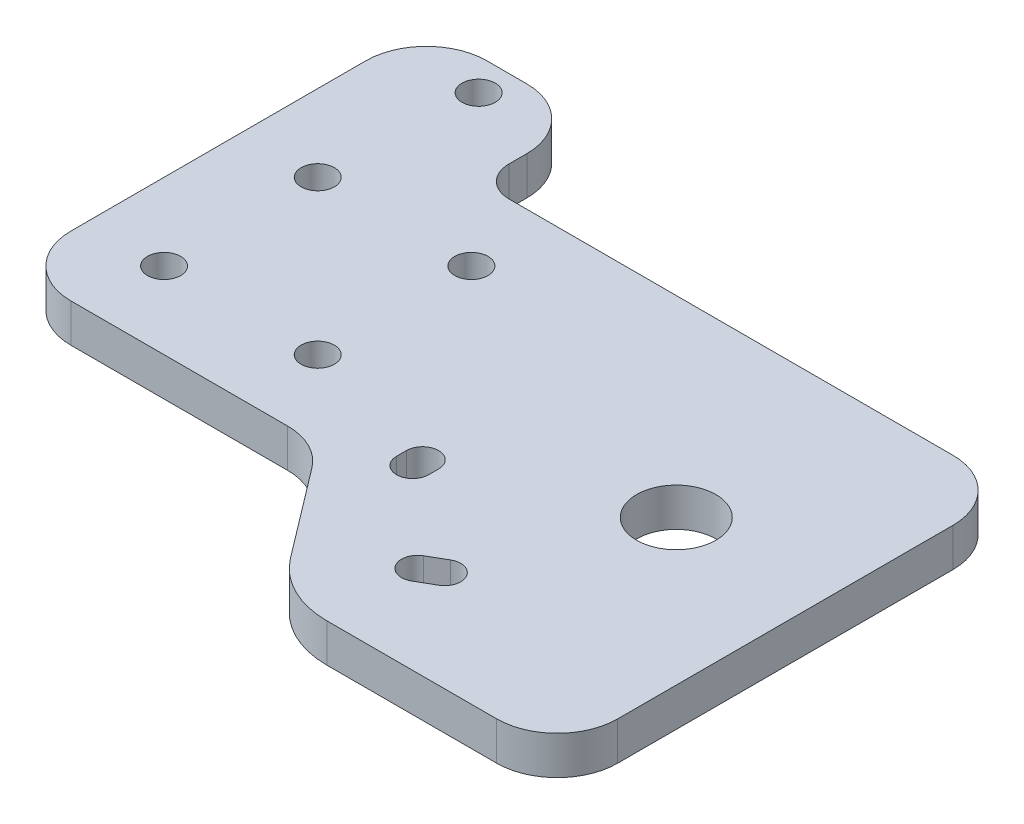
ISO-10303-21;
HEADER;
FILE_DESCRIPTION(('STEP AP214'),'2;1');
FILE_NAME('part.step','',(''),(''),'','','');
FILE_SCHEMA(('AUTOMOTIVE_DESIGN { 1 0 10303 214 1 1 1 1 }'));
ENDSEC;
DATA;
#1=APPLICATION_CONTEXT('core data for automotive mechanical design processes');
#2=APPLICATION_PROTOCOL_DEFINITION('international standard','automotive_design',2000,#1);
#3=PRODUCT_CONTEXT('',#1,'mechanical');
#4=PRODUCT('Part','Part','',(#3));
#5=PRODUCT_RELATED_PRODUCT_CATEGORY('part','',(#4));
#6=PRODUCT_DEFINITION_FORMATION('','',#4);
#7=PRODUCT_DEFINITION_CONTEXT('part definition',#1,'design');
#8=PRODUCT_DEFINITION('design','',#6,#7);
#9=PRODUCT_DEFINITION_SHAPE('','',#8);
#10=(LENGTH_UNIT() NAMED_UNIT(*) SI_UNIT(.MILLI.,.METRE.));
#11=(NAMED_UNIT(*) PLANE_ANGLE_UNIT() SI_UNIT($,.RADIAN.));
#12=(NAMED_UNIT(*) SI_UNIT($,.STERADIAN.) SOLID_ANGLE_UNIT());
#13=UNCERTAINTY_MEASURE_WITH_UNIT(LENGTH_MEASURE(1.E-05),#10,'distance_accuracy_value','');
#14=(GEOMETRIC_REPRESENTATION_CONTEXT(3) GLOBAL_UNCERTAINTY_ASSIGNED_CONTEXT((#13)) GLOBAL_UNIT_ASSIGNED_CONTEXT((#10,
#11,#12)) REPRESENTATION_CONTEXT('',''));
#15=CARTESIAN_POINT('',(0.,0.,0.));
#16=DIRECTION('',(0.,0.,1.));
#17=DIRECTION('',(1.,0.,0.));
#18=AXIS2_PLACEMENT_3D('',#15,#16,#17);
#19=CARTESIAN_POINT('',(-25.4,6.35,25.4));
#20=DIRECTION('',(1.,0.,0.));
#21=DIRECTION('',(0.,0.,-1.));
#22=AXIS2_PLACEMENT_3D('',#19,#20,#21);
#23=PLANE('',#22);
#24=DIRECTION('',(0.,0.,1.));
#25=VECTOR('',#24,1.);
#26=CARTESIAN_POINT('',(-25.4,6.35,-25.4));
#27=LINE('',#26,#25);
#28=CARTESIAN_POINT('',(-25.4,6.35,-33.35));
#29=VERTEX_POINT('',#28);
#30=CARTESIAN_POINT('',(-25.4,6.35,15.4));
#31=VERTEX_POINT('',#30);
#32=EDGE_CURVE('E303',#29,#31,#27,.T.);
#33=ORIENTED_EDGE('',*,*,#32,.F.);
#34=DIRECTION('',(0.,-1.,0.));
#35=VECTOR('',#34,1.);
#36=CARTESIAN_POINT('',(-25.4,6.35,-33.35));
#37=LINE('',#36,#35);
#38=CARTESIAN_POINT('',(-25.4,0.,-33.35));
#39=VERTEX_POINT('',#38);
#40=EDGE_CURVE('E356',#29,#39,#37,.T.);
#41=ORIENTED_EDGE('',*,*,#40,.T.);
#42=DIRECTION('',(0.,0.,1.));
#43=VECTOR('',#42,1.);
#44=CARTESIAN_POINT('',(-25.4,0.,25.4));
#45=LINE('',#44,#43);
#46=CARTESIAN_POINT('',(-25.4,0.,15.4));
#47=VERTEX_POINT('',#46);
#48=EDGE_CURVE('E302',#39,#47,#45,.T.);
#49=ORIENTED_EDGE('',*,*,#48,.T.);
#50=DIRECTION('',(0.,-1.,0.));
#51=VECTOR('',#50,1.);
#52=CARTESIAN_POINT('',(-25.4,6.35,15.4));
#53=LINE('',#52,#51);
#54=EDGE_CURVE('E354',#47,#31,#53,.F.);
#55=ORIENTED_EDGE('',*,*,#54,.T.);
#56=EDGE_LOOP('',(#33,#41,#49,#55));
#57=FACE_BOUND('',#56,.T.);
#58=ADVANCED_FACE('F32',(#57),#23,.F.);
#59=CARTESIAN_POINT('',(25.4,6.35,25.4));
#60=DIRECTION('',(0.,0.,-1.));
#61=DIRECTION('',(-1.,0.,0.));
#62=AXIS2_PLACEMENT_3D('',#59,#60,#61);
#63=PLANE('',#62);
#64=DIRECTION('',(1.,0.,0.));
#65=VECTOR('',#64,1.);
#66=CARTESIAN_POINT('',(25.4,6.35,25.4));
#67=LINE('',#66,#65);
#68=CARTESIAN_POINT('',(-15.4,6.35,25.4));
#69=VERTEX_POINT('',#68);
#70=CARTESIAN_POINT('',(20.4344979889263,6.35,25.4));
#71=VERTEX_POINT('',#70);
#72=EDGE_CURVE('E306',#69,#71,#67,.T.);
#73=ORIENTED_EDGE('',*,*,#72,.F.);
#74=DIRECTION('',(0.,-1.,0.));
#75=VECTOR('',#74,1.);
#76=CARTESIAN_POINT('',(-15.4,6.35,25.4));
#77=LINE('',#76,#75);
#78=CARTESIAN_POINT('',(-15.4,0.,25.4));
#79=VERTEX_POINT('',#78);
#80=EDGE_CURVE('E397',#69,#79,#77,.T.);
#81=ORIENTED_EDGE('',*,*,#80,.T.);
#82=DIRECTION('',(1.,0.,0.));
#83=VECTOR('',#82,1.);
#84=CARTESIAN_POINT('',(25.4,0.,25.4));
#85=LINE('',#84,#83);
#86=CARTESIAN_POINT('',(20.4344979889263,0.,25.4));
#87=VERTEX_POINT('',#86);
#88=EDGE_CURVE('E330',#79,#87,#85,.T.);
#89=ORIENTED_EDGE('',*,*,#88,.T.);
#90=DIRECTION('',(0.,-1.,0.));
#91=VECTOR('',#90,1.);
#92=CARTESIAN_POINT('',(20.4344979889263,6.35,25.4));
#93=LINE('',#92,#91);
#94=EDGE_CURVE('E395',#87,#71,#93,.F.);
#95=ORIENTED_EDGE('',*,*,#94,.T.);
#96=EDGE_LOOP('',(#73,#81,#89,#95));
#97=FACE_BOUND('',#96,.T.);
#98=ADVANCED_FACE('F446',(#97),#63,.F.);
#99=CARTESIAN_POINT('',(25.4,6.35,25.4));
#100=DIRECTION('',(0.796671421701581,0.,-0.604412645337589));
#101=DIRECTION('',(-0.604412645337589,0.,-0.796671421701581));
#102=AXIS2_PLACEMENT_3D('',#99,#100,#101);
#103=PLANE('',#102);
#104=DIRECTION('',(0.604412645337589,0.,0.796671421701581));
#105=VECTOR('',#104,1.);
#106=CARTESIAN_POINT('',(25.4,6.35,25.4));
#107=LINE('',#106,#105);
#108=CARTESIAN_POINT('',(28.4012122059421,6.35,29.3558735466241));
#109=VERTEX_POINT('',#108);
#110=CARTESIAN_POINT('',(39.5918704257842,6.35,44.1061896800638));
#111=VERTEX_POINT('',#110);
#112=EDGE_CURVE('E310',#109,#111,#107,.T.);
#113=ORIENTED_EDGE('',*,*,#112,.F.);
#114=DIRECTION('',(0.,-1.,0.));
#115=VECTOR('',#114,1.);
#116=CARTESIAN_POINT('',(28.4012122059421,0.,29.3558735466241));
#117=LINE('',#116,#115);
#118=CARTESIAN_POINT('',(28.4012122059421,0.,29.3558735466241));
#119=VERTEX_POINT('',#118);
#120=EDGE_CURVE('E400',#109,#119,#117,.T.);
#121=ORIENTED_EDGE('',*,*,#120,.T.);
#122=DIRECTION('',(0.604412645337589,0.,0.796671421701581));
#123=VECTOR('',#122,1.);
#124=CARTESIAN_POINT('',(25.4,0.,25.4));
#125=LINE('',#124,#123);
#126=CARTESIAN_POINT('',(39.5918704257842,0.,44.1061896800638));
#127=VERTEX_POINT('',#126);
#128=EDGE_CURVE('E333',#119,#127,#125,.T.);
#129=ORIENTED_EDGE('',*,*,#128,.T.);
#130=DIRECTION('',(0.,-1.,0.));
#131=VECTOR('',#130,1.);
#132=CARTESIAN_POINT('',(39.5918704257842,6.35,44.1061896800638));
#133=LINE('',#132,#131);
#134=EDGE_CURVE('E351',#111,#127,#133,.T.);
#135=ORIENTED_EDGE('',*,*,#134,.F.);
#136=EDGE_LOOP('',(#113,#121,#129,#135));
#137=FACE_BOUND('',#136,.T.);
#138=ADVANCED_FACE('F455',(#137),#103,.F.);
#139=CARTESIAN_POINT('',(51.5419417513079,6.35,35.04));
#140=DIRECTION('',(0.,-1.,0.));
#141=DIRECTION('',(0.,0.,-1.));
#142=AXIS2_PLACEMENT_3D('',#139,#140,#141);
#143=CYLINDRICAL_SURFACE('',#142,15.);
#144=CARTESIAN_POINT('',(51.5419417513079,0.,35.04));
#145=DIRECTION('',(0.,1.,0.));
#146=DIRECTION('',(0.,0.,1.));
#147=AXIS2_PLACEMENT_3D('',#144,#145,#146);
#148=CIRCLE('',#147,15.);
#149=CARTESIAN_POINT('',(51.5419417513079,0.,50.04));
#150=VERTEX_POINT('',#149);
#151=EDGE_CURVE('E335',#127,#150,#148,.T.);
#152=ORIENTED_EDGE('',*,*,#151,.T.);
#153=DIRECTION('',(0.,-1.,0.));
#154=VECTOR('',#153,1.);
#155=CARTESIAN_POINT('',(51.5419417513079,6.35,50.04));
#156=LINE('',#155,#154);
#157=CARTESIAN_POINT('',(51.5419417513079,6.35,50.04));
#158=VERTEX_POINT('',#157);
#159=EDGE_CURVE('E327',#158,#150,#156,.T.);
#160=ORIENTED_EDGE('',*,*,#159,.F.);
#161=CARTESIAN_POINT('',(51.5419417513079,6.35,35.04));
#162=DIRECTION('',(0.,1.,0.));
#163=DIRECTION('',(0.,0.,1.));
#164=AXIS2_PLACEMENT_3D('',#161,#162,#163);
#165=CIRCLE('',#164,15.);
#166=EDGE_CURVE('E312',#111,#158,#165,.T.);
#167=ORIENTED_EDGE('',*,*,#166,.F.);
#168=ORIENTED_EDGE('',*,*,#134,.T.);
#169=EDGE_LOOP('',(#152,#160,#167,#168));
#170=FACE_BOUND('',#169,.T.);
#171=ADVANCED_FACE('F461',(#170),#143,.T.);
#172=CARTESIAN_POINT('',(51.5419417513079,6.35,50.04));
#173=DIRECTION('',(0.,0.,-1.));
#174=DIRECTION('',(-1.,0.,0.));
#175=AXIS2_PLACEMENT_3D('',#172,#173,#174);
#176=PLANE('',#175);
#177=DIRECTION('',(1.,0.,0.));
#178=VECTOR('',#177,1.);
#179=CARTESIAN_POINT('',(51.5419417513079,0.,50.04));
#180=LINE('',#179,#178);
#181=CARTESIAN_POINT('',(79.6212098591925,0.,50.04));
#182=VERTEX_POINT('',#181);
#183=EDGE_CURVE('E337',#150,#182,#180,.T.);
#184=ORIENTED_EDGE('',*,*,#183,.T.);
#185=DIRECTION('',(0.,-1.,0.));
#186=VECTOR('',#185,1.);
#187=CARTESIAN_POINT('',(79.6212098591925,6.35,50.04));
#188=LINE('',#187,#186);
#189=CARTESIAN_POINT('',(79.6212098591925,6.35,50.04));
#190=VERTEX_POINT('',#189);
#191=EDGE_CURVE('E393',#182,#190,#188,.F.);
#192=ORIENTED_EDGE('',*,*,#191,.T.);
#193=DIRECTION('',(1.,0.,0.));
#194=VECTOR('',#193,1.);
#195=CARTESIAN_POINT('',(51.5419417513079,6.35,50.04));
#196=LINE('',#195,#194);
#197=EDGE_CURVE('E314',#158,#190,#196,.T.);
#198=ORIENTED_EDGE('',*,*,#197,.F.);
#199=ORIENTED_EDGE('',*,*,#159,.T.);
#200=EDGE_LOOP('',(#184,#192,#198,#199));
#201=FACE_BOUND('',#200,.T.);
#202=ADVANCED_FACE('F726',(#201),#176,.F.);
#203=CARTESIAN_POINT('',(89.6212098591925,6.35,50.04));
#204=DIRECTION('',(-1.,0.,0.));
#205=DIRECTION('',(0.,0.,1.));
#206=AXIS2_PLACEMENT_3D('',#203,#204,#205);
#207=PLANE('',#206);
#208=DIRECTION('',(0.,0.,-1.));
#209=VECTOR('',#208,1.);
#210=CARTESIAN_POINT('',(89.6212098591925,6.35,50.04));
#211=LINE('',#210,#209);
#212=CARTESIAN_POINT('',(89.6212098591925,6.35,40.04));
#213=VERTEX_POINT('',#212);
#214=CARTESIAN_POINT('',(89.6212098591925,6.35,-15.4));
#215=VERTEX_POINT('',#214);
#216=EDGE_CURVE('E317',#213,#215,#211,.T.);
#217=ORIENTED_EDGE('',*,*,#216,.F.);
#218=DIRECTION('',(0.,-1.,0.));
#219=VECTOR('',#218,1.);
#220=CARTESIAN_POINT('',(89.6212098591925,6.35,40.04));
#221=LINE('',#220,#219);
#222=CARTESIAN_POINT('',(89.6212098591925,0.,40.04));
#223=VERTEX_POINT('',#222);
#224=EDGE_CURVE('E390',#213,#223,#221,.T.);
#225=ORIENTED_EDGE('',*,*,#224,.T.);
#226=DIRECTION('',(0.,0.,-1.));
#227=VECTOR('',#226,1.);
#228=CARTESIAN_POINT('',(89.6212098591925,0.,50.04));
#229=LINE('',#228,#227);
#230=CARTESIAN_POINT('',(89.6212098591925,0.,-15.4));
#231=VERTEX_POINT('',#230);
#232=EDGE_CURVE('E340',#223,#231,#229,.T.);
#233=ORIENTED_EDGE('',*,*,#232,.T.);
#234=DIRECTION('',(0.,-1.,0.));
#235=VECTOR('',#234,1.);
#236=CARTESIAN_POINT('',(89.6212098591925,6.35,-15.4));
#237=LINE('',#236,#235);
#238=EDGE_CURVE('E388',#231,#215,#237,.F.);
#239=ORIENTED_EDGE('',*,*,#238,.T.);
#240=EDGE_LOOP('',(#217,#225,#233,#239));
#241=FACE_BOUND('',#240,.T.);
#242=ADVANCED_FACE('F472',(#241),#207,.F.);
#243=CARTESIAN_POINT('',(1.2,6.35,-25.4));
#244=DIRECTION('',(0.,0.,1.));
#245=DIRECTION('',(1.,0.,0.));
#246=AXIS2_PLACEMENT_3D('',#243,#244,#245);
#247=PLANE('',#246);
#248=DIRECTION('',(-1.,0.,0.));
#249=VECTOR('',#248,1.);
#250=CARTESIAN_POINT('',(1.2,0.,-25.4));
#251=LINE('',#250,#249);
#252=CARTESIAN_POINT('',(79.6212098591925,0.,-25.4));
#253=VERTEX_POINT('',#252);
#254=CARTESIAN_POINT('',(6.2,0.,-25.4));
#255=VERTEX_POINT('',#254);
#256=EDGE_CURVE('E343',#253,#255,#251,.T.);
#257=ORIENTED_EDGE('',*,*,#256,.T.);
#258=DIRECTION('',(0.,-1.,0.));
#259=VECTOR('',#258,1.);
#260=CARTESIAN_POINT('',(6.2,6.35,-25.4));
#261=LINE('',#260,#259);
#262=CARTESIAN_POINT('',(6.2,6.35,-25.4));
#263=VERTEX_POINT('',#262);
#264=EDGE_CURVE('E53',#255,#263,#261,.F.);
#265=ORIENTED_EDGE('',*,*,#264,.T.);
#266=DIRECTION('',(-1.,0.,0.));
#267=VECTOR('',#266,1.);
#268=CARTESIAN_POINT('',(89.6212098591925,6.35,-25.4));
#269=LINE('',#268,#267);
#270=CARTESIAN_POINT('',(79.6212098591925,6.35,-25.4));
#271=VERTEX_POINT('',#270);
#272=EDGE_CURVE('E320',#271,#263,#269,.T.);
#273=ORIENTED_EDGE('',*,*,#272,.F.);
#274=DIRECTION('',(0.,-1.,0.));
#275=VECTOR('',#274,1.);
#276=CARTESIAN_POINT('',(79.6212098591925,6.35,-25.4));
#277=LINE('',#276,#275);
#278=EDGE_CURVE('E403',#271,#253,#277,.T.);
#279=ORIENTED_EDGE('',*,*,#278,.T.);
#280=EDGE_LOOP('',(#257,#265,#273,#279));
#281=FACE_BOUND('',#280,.T.);
#282=ADVANCED_FACE('F479',(#281),#247,.F.);
#283=CARTESIAN_POINT('',(1.2,6.35,-43.35));
#284=DIRECTION('',(-1.,0.,0.));
#285=DIRECTION('',(0.,0.,1.));
#286=AXIS2_PLACEMENT_3D('',#283,#284,#285);
#287=PLANE('',#286);
#288=DIRECTION('',(0.,0.,-1.));
#289=VECTOR('',#288,1.);
#290=CARTESIAN_POINT('',(1.2,6.35,-43.35));
#291=LINE('',#290,#289);
#292=CARTESIAN_POINT('',(1.2,6.35,-30.4));
#293=VERTEX_POINT('',#292);
#294=CARTESIAN_POINT('',(1.2,6.35,-33.35));
#295=VERTEX_POINT('',#294);
#296=EDGE_CURVE('E322',#293,#295,#291,.T.);
#297=ORIENTED_EDGE('',*,*,#296,.F.);
#298=DIRECTION('',(0.,-1.,0.));
#299=VECTOR('',#298,1.);
#300=CARTESIAN_POINT('',(1.2,0.,-30.4));
#301=LINE('',#300,#299);
#302=CARTESIAN_POINT('',(1.2,0.,-30.4));
#303=VERTEX_POINT('',#302);
#304=EDGE_CURVE('E410',#293,#303,#301,.T.);
#305=ORIENTED_EDGE('',*,*,#304,.T.);
#306=DIRECTION('',(0.,0.,-1.));
#307=VECTOR('',#306,1.);
#308=CARTESIAN_POINT('',(1.2,0.,-43.35));
#309=LINE('',#308,#307);
#310=CARTESIAN_POINT('',(1.2,0.,-33.35));
#311=VERTEX_POINT('',#310);
#312=EDGE_CURVE('E345',#303,#311,#309,.T.);
#313=ORIENTED_EDGE('',*,*,#312,.T.);
#314=DIRECTION('',(0.,-1.,0.));
#315=VECTOR('',#314,1.);
#316=CARTESIAN_POINT('',(1.2,6.35,-33.35));
#317=LINE('',#316,#315);
#318=EDGE_CURVE('E385',#311,#295,#317,.F.);
#319=ORIENTED_EDGE('',*,*,#318,.T.);
#320=EDGE_LOOP('',(#297,#305,#313,#319));
#321=FACE_BOUND('',#320,.T.);
#322=ADVANCED_FACE('F416',(#321),#287,.F.);
#323=CARTESIAN_POINT('',(-25.4,6.35,-43.35));
#324=DIRECTION('',(0.,0.,1.));
#325=DIRECTION('',(1.,0.,0.));
#326=AXIS2_PLACEMENT_3D('',#323,#324,#325);
#327=PLANE('',#326);
#328=DIRECTION('',(-1.,0.,0.));
#329=VECTOR('',#328,1.);
#330=CARTESIAN_POINT('',(-25.4,0.,-43.35));
#331=LINE('',#330,#329);
#332=CARTESIAN_POINT('',(-8.80000000000001,0.,-43.35));
#333=VERTEX_POINT('',#332);
#334=CARTESIAN_POINT('',(-15.4,0.,-43.35));
#335=VERTEX_POINT('',#334);
#336=EDGE_CURVE('E307',#333,#335,#331,.T.);
#337=ORIENTED_EDGE('',*,*,#336,.T.);
#338=DIRECTION('',(0.,-1.,0.));
#339=VECTOR('',#338,1.);
#340=CARTESIAN_POINT('',(-15.4,6.35,-43.35));
#341=LINE('',#340,#339);
#342=CARTESIAN_POINT('',(-15.4,6.35,-43.35));
#343=VERTEX_POINT('',#342);
#344=EDGE_CURVE('E373',#335,#343,#341,.F.);
#345=ORIENTED_EDGE('',*,*,#344,.T.);
#346=DIRECTION('',(-1.,0.,0.));
#347=VECTOR('',#346,1.);
#348=CARTESIAN_POINT('',(-25.4,6.35,-43.35));
#349=LINE('',#348,#347);
#350=CARTESIAN_POINT('',(-8.80000000000001,6.35,-43.35));
#351=VERTEX_POINT('',#350);
#352=EDGE_CURVE('E324',#351,#343,#349,.T.);
#353=ORIENTED_EDGE('',*,*,#352,.F.);
#354=DIRECTION('',(0.,-1.,0.));
#355=VECTOR('',#354,1.);
#356=CARTESIAN_POINT('',(-8.8,6.35,-43.35));
#357=LINE('',#356,#355);
#358=EDGE_CURVE('E370',#351,#333,#357,.T.);
#359=ORIENTED_EDGE('',*,*,#358,.T.);
#360=EDGE_LOOP('',(#337,#345,#353,#359));
#361=FACE_BOUND('',#360,.T.);
#362=ADVANCED_FACE('F431',(#361),#327,.F.);
#363=CARTESIAN_POINT('',(51.5419417513079,6.35,35.04));
#364=DIRECTION('',(0.,1.,0.));
#365=DIRECTION('',(0.,0.,1.));
#366=AXIS2_PLACEMENT_3D('',#363,#364,#365);
#367=PLANE('',#366);
#368=CARTESIAN_POINT('',(65.6212098591924,6.35,6.36));
#369=DIRECTION('',(0.,1.,0.));
#370=DIRECTION('',(0.,0.,1.));
#371=AXIS2_PLACEMENT_3D('',#368,#369,#370);
#372=CIRCLE('',#371,6.55);
#373=CARTESIAN_POINT('',(65.6212098591924,6.35,12.91));
#374=VERTEX_POINT('',#373);
#375=EDGE_CURVE('E224',#374,#374,#372,.T.);
#376=ORIENTED_EDGE('',*,*,#375,.F.);
#377=EDGE_LOOP('',(#376));
#378=FACE_BOUND('',#377,.T.);
#379=CARTESIAN_POINT('',(36.4,6.35,19.08));
#380=DIRECTION('',(0.,1.,0.));
#381=DIRECTION('',(0.,0.,-1.));
#382=AXIS2_PLACEMENT_3D('',#379,#380,#381);
#383=CIRCLE('',#382,2.65);
#384=CARTESIAN_POINT('',(39.05,6.35,19.08));
#385=VERTEX_POINT('',#384);
#386=CARTESIAN_POINT('',(33.75,6.35,19.08));
#387=VERTEX_POINT('',#386);
#388=EDGE_CURVE('E200',#385,#387,#383,.T.);
#389=ORIENTED_EDGE('',*,*,#388,.F.);
#390=DIRECTION('',(0.,0.,-1.));
#391=VECTOR('',#390,1.);
#392=CARTESIAN_POINT('',(39.05,6.35,19.08));
#393=LINE('',#392,#391);
#394=CARTESIAN_POINT('',(39.05,6.35,20.72));
#395=VERTEX_POINT('',#394);
#396=EDGE_CURVE('E218',#395,#385,#393,.T.);
#397=ORIENTED_EDGE('',*,*,#396,.F.);
#398=CARTESIAN_POINT('',(36.4,6.35,20.72));
#399=DIRECTION('',(0.,1.,0.));
#400=DIRECTION('',(0.,0.,1.));
#401=AXIS2_PLACEMENT_3D('',#398,#399,#400);
#402=CIRCLE('',#401,2.65);
#403=CARTESIAN_POINT('',(33.75,6.35,20.72));
#404=VERTEX_POINT('',#403);
#405=EDGE_CURVE('E221',#404,#395,#402,.T.);
#406=ORIENTED_EDGE('',*,*,#405,.F.);
#407=DIRECTION('',(0.,0.,1.));
#408=VECTOR('',#407,1.);
#409=CARTESIAN_POINT('',(33.75,6.35,19.08));
#410=LINE('',#409,#408);
#411=EDGE_CURVE('E230',#387,#404,#410,.T.);
#412=ORIENTED_EDGE('',*,*,#411,.F.);
#413=EDGE_LOOP('',(#389,#397,#406,#412));
#414=FACE_BOUND('',#413,.T.);
#415=CARTESIAN_POINT('',(54.3782535303071,6.35,33.4));
#416=DIRECTION('',(0.,1.,0.));
#417=DIRECTION('',(0.,0.,-1.));
#418=AXIS2_PLACEMENT_3D('',#415,#416,#417);
#419=CIRCLE('',#418,2.65);
#420=CARTESIAN_POINT('',(55.7047422942252,6.35,35.6941071376897));
#421=VERTEX_POINT('',#420);
#422=CARTESIAN_POINT('',(53.051764766389,6.35,31.1058928623103));
#423=VERTEX_POINT('',#422);
#424=EDGE_CURVE('E237',#421,#423,#419,.T.);
#425=ORIENTED_EDGE('',*,*,#424,.F.);
#426=DIRECTION('',(0.865700806675368,0.,-0.500561797704955));
#427=VECTOR('',#426,1.);
#428=CARTESIAN_POINT('',(55.7047422942252,6.35,35.6941071376897));
#429=LINE('',#428,#427);
#430=CARTESIAN_POINT('',(52.868430515226,6.35,37.3341071376897));
#431=VERTEX_POINT('',#430);
#432=EDGE_CURVE('E245',#431,#421,#429,.T.);
#433=ORIENTED_EDGE('',*,*,#432,.F.);
#434=CARTESIAN_POINT('',(51.5419417513079,6.35,35.04));
#435=DIRECTION('',(0.,1.,0.));
#436=DIRECTION('',(0.,0.,1.));
#437=AXIS2_PLACEMENT_3D('',#434,#435,#436);
#438=CIRCLE('',#437,2.65);
#439=CARTESIAN_POINT('',(50.2154529873897,6.35,32.7458928623103));
#440=VERTEX_POINT('',#439);
#441=EDGE_CURVE('E259',#440,#431,#438,.T.);
#442=ORIENTED_EDGE('',*,*,#441,.F.);
#443=DIRECTION('',(-0.865700806675368,0.,0.500561797704955));
#444=VECTOR('',#443,1.);
#445=CARTESIAN_POINT('',(53.051764766389,6.35,31.1058928623103));
#446=LINE('',#445,#444);
#447=EDGE_CURVE('E256',#423,#440,#446,.T.);
#448=ORIENTED_EDGE('',*,*,#447,.F.);
#449=EDGE_LOOP('',(#425,#433,#442,#448));
#450=FACE_BOUND('',#449,.T.);
#451=CARTESIAN_POINT('',(-12.7,6.35,-12.7));
#452=DIRECTION('',(0.,1.,0.));
#453=DIRECTION('',(0.,0.,1.));
#454=AXIS2_PLACEMENT_3D('',#451,#452,#453);
#455=CIRCLE('',#454,2.74999999999999);
#456=CARTESIAN_POINT('',(-12.7,6.35,-9.95000000000001));
#457=VERTEX_POINT('',#456);
#458=EDGE_CURVE('E266',#457,#457,#455,.T.);
#459=ORIENTED_EDGE('',*,*,#458,.F.);
#460=EDGE_LOOP('',(#459));
#461=FACE_BOUND('',#460,.T.);
#462=CARTESIAN_POINT('',(12.7,6.35,-12.7));
#463=DIRECTION('',(0.,1.,0.));
#464=DIRECTION('',(0.,0.,1.));
#465=AXIS2_PLACEMENT_3D('',#462,#463,#464);
#466=CIRCLE('',#465,2.74999999999999);
#467=CARTESIAN_POINT('',(12.7,6.35,-9.95000000000001));
#468=VERTEX_POINT('',#467);
#469=EDGE_CURVE('E278',#468,#468,#466,.T.);
#470=ORIENTED_EDGE('',*,*,#469,.F.);
#471=EDGE_LOOP('',(#470));
#472=FACE_BOUND('',#471,.T.);
#473=CARTESIAN_POINT('',(12.7,6.35,12.7));
#474=DIRECTION('',(0.,1.,0.));
#475=DIRECTION('',(0.,0.,1.));
#476=AXIS2_PLACEMENT_3D('',#473,#474,#475);
#477=CIRCLE('',#476,2.74999999999999);
#478=CARTESIAN_POINT('',(12.7,6.35,15.45));
#479=VERTEX_POINT('',#478);
#480=EDGE_CURVE('E284',#479,#479,#477,.T.);
#481=ORIENTED_EDGE('',*,*,#480,.F.);
#482=EDGE_LOOP('',(#481));
#483=FACE_BOUND('',#482,.T.);
#484=CARTESIAN_POINT('',(-12.7,6.35,12.7));
#485=DIRECTION('',(0.,1.,0.));
#486=DIRECTION('',(0.,0.,1.));
#487=AXIS2_PLACEMENT_3D('',#484,#485,#486);
#488=CIRCLE('',#487,2.74999999999999);
#489=CARTESIAN_POINT('',(-12.7,6.35,15.45));
#490=VERTEX_POINT('',#489);
#491=EDGE_CURVE('E290',#490,#490,#488,.T.);
#492=ORIENTED_EDGE('',*,*,#491,.F.);
#493=EDGE_LOOP('',(#492));
#494=FACE_BOUND('',#493,.T.);
#495=CARTESIAN_POINT('',(-11.5,6.35,-38.1));
#496=DIRECTION('',(0.,1.,0.));
#497=DIRECTION('',(0.,0.,1.));
#498=AXIS2_PLACEMENT_3D('',#495,#496,#497);
#499=CIRCLE('',#498,2.74999999999999);
#500=CARTESIAN_POINT('',(-11.5,6.35,-35.35));
#501=VERTEX_POINT('',#500);
#502=EDGE_CURVE('E296',#501,#501,#499,.T.);
#503=ORIENTED_EDGE('',*,*,#502,.F.);
#504=EDGE_LOOP('',(#503));
#505=FACE_BOUND('',#504,.T.);
#506=ORIENTED_EDGE('',*,*,#352,.T.);
#507=CARTESIAN_POINT('',(-15.4,6.35,-33.35));
#508=DIRECTION('',(0.,1.,0.));
#509=DIRECTION('',(0.,0.,1.));
#510=AXIS2_PLACEMENT_3D('',#507,#508,#509);
#511=CIRCLE('',#510,10.);
#512=EDGE_CURVE('E383',#343,#29,#511,.T.);
#513=ORIENTED_EDGE('',*,*,#512,.T.);
#514=ORIENTED_EDGE('',*,*,#32,.T.);
#515=CARTESIAN_POINT('',(-15.4,6.35,15.4));
#516=DIRECTION('',(0.,1.,0.));
#517=DIRECTION('',(0.,0.,1.));
#518=AXIS2_PLACEMENT_3D('',#515,#516,#517);
#519=CIRCLE('',#518,10.);
#520=EDGE_CURVE('E377',#31,#69,#519,.T.);
#521=ORIENTED_EDGE('',*,*,#520,.T.);
#522=ORIENTED_EDGE('',*,*,#72,.T.);
#523=CARTESIAN_POINT('',(20.4344979889263,6.35,35.4));
#524=DIRECTION('',(0.,1.,0.));
#525=DIRECTION('',(0.,0.,1.));
#526=AXIS2_PLACEMENT_3D('',#523,#524,#525);
#527=CIRCLE('',#526,10.);
#528=EDGE_CURVE('E408',#71,#109,#527,.F.);
#529=ORIENTED_EDGE('',*,*,#528,.T.);
#530=ORIENTED_EDGE('',*,*,#112,.T.);
#531=ORIENTED_EDGE('',*,*,#166,.T.);
#532=ORIENTED_EDGE('',*,*,#197,.T.);
#533=CARTESIAN_POINT('',(79.6212098591925,6.35,40.04));
#534=DIRECTION('',(0.,1.,0.));
#535=DIRECTION('',(0.,0.,1.));
#536=AXIS2_PLACEMENT_3D('',#533,#534,#535);
#537=CIRCLE('',#536,10.);
#538=EDGE_CURVE('E379',#190,#213,#537,.T.);
#539=ORIENTED_EDGE('',*,*,#538,.T.);
#540=ORIENTED_EDGE('',*,*,#216,.T.);
#541=CARTESIAN_POINT('',(79.6212098591925,6.35,-15.4));
#542=DIRECTION('',(0.,1.,0.));
#543=DIRECTION('',(0.,0.,1.));
#544=AXIS2_PLACEMENT_3D('',#541,#542,#543);
#545=CIRCLE('',#544,10.);
#546=EDGE_CURVE('E375',#215,#271,#545,.T.);
#547=ORIENTED_EDGE('',*,*,#546,.T.);
#548=ORIENTED_EDGE('',*,*,#272,.T.);
#549=CARTESIAN_POINT('',(6.2,6.35,-30.4));
#550=DIRECTION('',(0.,1.,0.));
#551=DIRECTION('',(0.,0.,1.));
#552=AXIS2_PLACEMENT_3D('',#549,#550,#551);
#553=CIRCLE('',#552,5.);
#554=EDGE_CURVE('E11',#263,#293,#553,.F.);
#555=ORIENTED_EDGE('',*,*,#554,.T.);
#556=ORIENTED_EDGE('',*,*,#296,.T.);
#557=CARTESIAN_POINT('',(-8.8,6.35,-33.35));
#558=DIRECTION('',(0.,1.,0.));
#559=DIRECTION('',(0.,0.,1.));
#560=AXIS2_PLACEMENT_3D('',#557,#558,#559);
#561=CIRCLE('',#560,10.);
#562=EDGE_CURVE('E381',#295,#351,#561,.T.);
#563=ORIENTED_EDGE('',*,*,#562,.T.);
#564=EDGE_LOOP('',(#506,#513,#514,#521,#522,#529,#530,#531,#532,#539,#540,#547,#548,#555,#556,#563));
#565=FACE_BOUND('',#564,.T.);
#566=ADVANCED_FACE('F428',(#378,#414,#450,#461,#472,#483,#494,#505,#565),#367,.T.);
#567=CARTESIAN_POINT('',(51.5419417513079,0.,35.04));
#568=DIRECTION('',(0.,1.,0.));
#569=DIRECTION('',(0.,0.,1.));
#570=AXIS2_PLACEMENT_3D('',#567,#568,#569);
#571=PLANE('',#570);
#572=CARTESIAN_POINT('',(65.6212098591924,0.,6.36));
#573=DIRECTION('',(0.,1.,0.));
#574=DIRECTION('',(0.,0.,1.));
#575=AXIS2_PLACEMENT_3D('',#572,#573,#574);
#576=CIRCLE('',#575,6.55);
#577=CARTESIAN_POINT('',(65.6212098591924,0.,12.91));
#578=VERTEX_POINT('',#577);
#579=EDGE_CURVE('E231',#578,#578,#576,.T.);
#580=ORIENTED_EDGE('',*,*,#579,.T.);
#581=EDGE_LOOP('',(#580));
#582=FACE_BOUND('',#581,.T.);
#583=DIRECTION('',(0.,0.,-1.));
#584=VECTOR('',#583,1.);
#585=CARTESIAN_POINT('',(39.05,0.,19.08));
#586=LINE('',#585,#584);
#587=CARTESIAN_POINT('',(39.05,0.,20.72));
#588=VERTEX_POINT('',#587);
#589=CARTESIAN_POINT('',(39.05,0.,19.08));
#590=VERTEX_POINT('',#589);
#591=EDGE_CURVE('E205',#588,#590,#586,.T.);
#592=ORIENTED_EDGE('',*,*,#591,.T.);
#593=CARTESIAN_POINT('',(36.4,0.,19.08));
#594=DIRECTION('',(0.,1.,0.));
#595=DIRECTION('',(0.,0.,-1.));
#596=AXIS2_PLACEMENT_3D('',#593,#594,#595);
#597=CIRCLE('',#596,2.65);
#598=CARTESIAN_POINT('',(33.75,0.,19.08));
#599=VERTEX_POINT('',#598);
#600=EDGE_CURVE('E197',#590,#599,#597,.T.);
#601=ORIENTED_EDGE('',*,*,#600,.T.);
#602=DIRECTION('',(0.,0.,1.));
#603=VECTOR('',#602,1.);
#604=CARTESIAN_POINT('',(33.75,0.,19.08));
#605=LINE('',#604,#603);
#606=CARTESIAN_POINT('',(33.75,0.,20.72));
#607=VERTEX_POINT('',#606);
#608=EDGE_CURVE('E209',#599,#607,#605,.T.);
#609=ORIENTED_EDGE('',*,*,#608,.T.);
#610=CARTESIAN_POINT('',(36.4,0.,20.72));
#611=DIRECTION('',(0.,1.,0.));
#612=DIRECTION('',(0.,0.,1.));
#613=AXIS2_PLACEMENT_3D('',#610,#611,#612);
#614=CIRCLE('',#613,2.65);
#615=EDGE_CURVE('E213',#607,#588,#614,.T.);
#616=ORIENTED_EDGE('',*,*,#615,.T.);
#617=EDGE_LOOP('',(#592,#601,#609,#616));
#618=FACE_BOUND('',#617,.T.);
#619=DIRECTION('',(0.865700806675368,0.,-0.500561797704955));
#620=VECTOR('',#619,1.);
#621=CARTESIAN_POINT('',(55.7047422942252,0.,35.6941071376897));
#622=LINE('',#621,#620);
#623=CARTESIAN_POINT('',(52.868430515226,0.,37.3341071376897));
#624=VERTEX_POINT('',#623);
#625=CARTESIAN_POINT('',(55.7047422942252,0.,35.6941071376897));
#626=VERTEX_POINT('',#625);
#627=EDGE_CURVE('E251',#624,#626,#622,.T.);
#628=ORIENTED_EDGE('',*,*,#627,.T.);
#629=CARTESIAN_POINT('',(54.3782535303071,0.,33.4));
#630=DIRECTION('',(0.,1.,0.));
#631=DIRECTION('',(0.,0.,-1.));
#632=AXIS2_PLACEMENT_3D('',#629,#630,#631);
#633=CIRCLE('',#632,2.65);
#634=CARTESIAN_POINT('',(53.051764766389,0.,31.1058928623103));
#635=VERTEX_POINT('',#634);
#636=EDGE_CURVE('E241',#626,#635,#633,.T.);
#637=ORIENTED_EDGE('',*,*,#636,.T.);
#638=DIRECTION('',(-0.865700806675368,0.,0.500561797704955));
#639=VECTOR('',#638,1.);
#640=CARTESIAN_POINT('',(53.051764766389,0.,31.1058928623103));
#641=LINE('',#640,#639);
#642=CARTESIAN_POINT('',(50.2154529873897,0.,32.7458928623103));
#643=VERTEX_POINT('',#642);
#644=EDGE_CURVE('E244',#635,#643,#641,.T.);
#645=ORIENTED_EDGE('',*,*,#644,.T.);
#646=CARTESIAN_POINT('',(51.5419417513079,0.,35.04));
#647=DIRECTION('',(0.,1.,0.));
#648=DIRECTION('',(0.,0.,1.));
#649=AXIS2_PLACEMENT_3D('',#646,#647,#648);
#650=CIRCLE('',#649,2.65);
#651=EDGE_CURVE('E248',#643,#624,#650,.T.);
#652=ORIENTED_EDGE('',*,*,#651,.T.);
#653=EDGE_LOOP('',(#628,#637,#645,#652));
#654=FACE_BOUND('',#653,.T.);
#655=CARTESIAN_POINT('',(-12.7,0.,-12.7));
#656=DIRECTION('',(0.,1.,0.));
#657=DIRECTION('',(0.,0.,1.));
#658=AXIS2_PLACEMENT_3D('',#655,#656,#657);
#659=CIRCLE('',#658,2.74999999999999);
#660=CARTESIAN_POINT('',(-12.7,0.,-9.95000000000001));
#661=VERTEX_POINT('',#660);
#662=EDGE_CURVE('E275',#661,#661,#659,.T.);
#663=ORIENTED_EDGE('',*,*,#662,.T.);
#664=EDGE_LOOP('',(#663));
#665=FACE_BOUND('',#664,.T.);
#666=CARTESIAN_POINT('',(12.7,0.,-12.7));
#667=DIRECTION('',(0.,1.,0.));
#668=DIRECTION('',(0.,0.,1.));
#669=AXIS2_PLACEMENT_3D('',#666,#667,#668);
#670=CIRCLE('',#669,2.74999999999999);
#671=CARTESIAN_POINT('',(12.7,0.,-9.95000000000001));
#672=VERTEX_POINT('',#671);
#673=EDGE_CURVE('E281',#672,#672,#670,.T.);
#674=ORIENTED_EDGE('',*,*,#673,.T.);
#675=EDGE_LOOP('',(#674));
#676=FACE_BOUND('',#675,.T.);
#677=CARTESIAN_POINT('',(12.7,0.,12.7));
#678=DIRECTION('',(0.,1.,0.));
#679=DIRECTION('',(0.,0.,1.));
#680=AXIS2_PLACEMENT_3D('',#677,#678,#679);
#681=CIRCLE('',#680,2.74999999999999);
#682=CARTESIAN_POINT('',(12.7,0.,15.45));
#683=VERTEX_POINT('',#682);
#684=EDGE_CURVE('E287',#683,#683,#681,.T.);
#685=ORIENTED_EDGE('',*,*,#684,.T.);
#686=EDGE_LOOP('',(#685));
#687=FACE_BOUND('',#686,.T.);
#688=CARTESIAN_POINT('',(-12.7,0.,12.7));
#689=DIRECTION('',(0.,1.,0.));
#690=DIRECTION('',(0.,0.,1.));
#691=AXIS2_PLACEMENT_3D('',#688,#689,#690);
#692=CIRCLE('',#691,2.74999999999999);
#693=CARTESIAN_POINT('',(-12.7,0.,15.45));
#694=VERTEX_POINT('',#693);
#695=EDGE_CURVE('E293',#694,#694,#692,.T.);
#696=ORIENTED_EDGE('',*,*,#695,.T.);
#697=EDGE_LOOP('',(#696));
#698=FACE_BOUND('',#697,.T.);
#699=CARTESIAN_POINT('',(-11.5,0.,-38.1));
#700=DIRECTION('',(0.,1.,0.));
#701=DIRECTION('',(0.,0.,1.));
#702=AXIS2_PLACEMENT_3D('',#699,#700,#701);
#703=CIRCLE('',#702,2.74999999999999);
#704=CARTESIAN_POINT('',(-11.5,0.,-35.35));
#705=VERTEX_POINT('',#704);
#706=EDGE_CURVE('E299',#705,#705,#703,.T.);
#707=ORIENTED_EDGE('',*,*,#706,.T.);
#708=EDGE_LOOP('',(#707));
#709=FACE_BOUND('',#708,.T.);
#710=ORIENTED_EDGE('',*,*,#48,.F.);
#711=CARTESIAN_POINT('',(-15.4,0.,-33.35));
#712=DIRECTION('',(0.,1.,0.));
#713=DIRECTION('',(0.,0.,1.));
#714=AXIS2_PLACEMENT_3D('',#711,#712,#713);
#715=CIRCLE('',#714,10.);
#716=EDGE_CURVE('E368',#39,#335,#715,.F.);
#717=ORIENTED_EDGE('',*,*,#716,.T.);
#718=ORIENTED_EDGE('',*,*,#336,.F.);
#719=CARTESIAN_POINT('',(-8.8,0.,-33.35));
#720=DIRECTION('',(0.,1.,0.));
#721=DIRECTION('',(0.,0.,1.));
#722=AXIS2_PLACEMENT_3D('',#719,#720,#721);
#723=CIRCLE('',#722,10.);
#724=EDGE_CURVE('E365',#333,#311,#723,.F.);
#725=ORIENTED_EDGE('',*,*,#724,.T.);
#726=ORIENTED_EDGE('',*,*,#312,.F.);
#727=CARTESIAN_POINT('',(6.2,0.,-30.4));
#728=DIRECTION('',(0.,1.,0.));
#729=DIRECTION('',(0.,0.,1.));
#730=AXIS2_PLACEMENT_3D('',#727,#728,#729);
#731=CIRCLE('',#730,5.);
#732=EDGE_CURVE('E40',#303,#255,#731,.T.);
#733=ORIENTED_EDGE('',*,*,#732,.T.);
#734=ORIENTED_EDGE('',*,*,#256,.F.);
#735=CARTESIAN_POINT('',(79.6212098591925,0.,-15.4));
#736=DIRECTION('',(0.,1.,0.));
#737=DIRECTION('',(0.,0.,1.));
#738=AXIS2_PLACEMENT_3D('',#735,#736,#737);
#739=CIRCLE('',#738,10.);
#740=EDGE_CURVE('E359',#253,#231,#739,.F.);
#741=ORIENTED_EDGE('',*,*,#740,.T.);
#742=ORIENTED_EDGE('',*,*,#232,.F.);
#743=CARTESIAN_POINT('',(79.6212098591925,0.,40.04));
#744=DIRECTION('',(0.,1.,0.));
#745=DIRECTION('',(0.,0.,1.));
#746=AXIS2_PLACEMENT_3D('',#743,#744,#745);
#747=CIRCLE('',#746,10.);
#748=EDGE_CURVE('E363',#223,#182,#747,.F.);
#749=ORIENTED_EDGE('',*,*,#748,.T.);
#750=ORIENTED_EDGE('',*,*,#183,.F.);
#751=ORIENTED_EDGE('',*,*,#151,.F.);
#752=ORIENTED_EDGE('',*,*,#128,.F.);
#753=CARTESIAN_POINT('',(20.4344979889263,0.,35.4));
#754=DIRECTION('',(0.,1.,0.));
#755=DIRECTION('',(0.,0.,1.));
#756=AXIS2_PLACEMENT_3D('',#753,#754,#755);
#757=CIRCLE('',#756,10.);
#758=EDGE_CURVE('E406',#119,#87,#757,.T.);
#759=ORIENTED_EDGE('',*,*,#758,.T.);
#760=ORIENTED_EDGE('',*,*,#88,.F.);
#761=CARTESIAN_POINT('',(-15.4,0.,15.4));
#762=DIRECTION('',(0.,1.,0.));
#763=DIRECTION('',(0.,0.,1.));
#764=AXIS2_PLACEMENT_3D('',#761,#762,#763);
#765=CIRCLE('',#764,10.);
#766=EDGE_CURVE('E361',#79,#47,#765,.F.);
#767=ORIENTED_EDGE('',*,*,#766,.T.);
#768=EDGE_LOOP('',(#710,#717,#718,#725,#726,#733,#734,#741,#742,#749,#750,#751,#752,#759,#760,#767));
#769=FACE_BOUND('',#768,.T.);
#770=ADVANCED_FACE('F215',(#582,#618,#654,#665,#676,#687,#698,#709,#769),#571,.F.);
#771=CARTESIAN_POINT('',(-11.5,6.35,-38.1));
#772=DIRECTION('',(0.,1.,0.));
#773=DIRECTION('',(0.,0.,1.));
#774=AXIS2_PLACEMENT_3D('',#771,#772,#773);
#775=CYLINDRICAL_SURFACE('',#774,2.74999999999999);
#776=ORIENTED_EDGE('',*,*,#706,.F.);
#777=EDGE_LOOP('',(#776));
#778=FACE_BOUND('',#777,.T.);
#779=ORIENTED_EDGE('',*,*,#502,.T.);
#780=EDGE_LOOP('',(#779));
#781=FACE_BOUND('',#780,.T.);
#782=ADVANCED_FACE('F551',(#778,#781),#775,.F.);
#783=CARTESIAN_POINT('',(-12.7,6.35,12.7));
#784=DIRECTION('',(0.,1.,0.));
#785=DIRECTION('',(0.,0.,1.));
#786=AXIS2_PLACEMENT_3D('',#783,#784,#785);
#787=CYLINDRICAL_SURFACE('',#786,2.74999999999999);
#788=ORIENTED_EDGE('',*,*,#695,.F.);
#789=EDGE_LOOP('',(#788));
#790=FACE_BOUND('',#789,.T.);
#791=ORIENTED_EDGE('',*,*,#491,.T.);
#792=EDGE_LOOP('',(#791));
#793=FACE_BOUND('',#792,.T.);
#794=ADVANCED_FACE('F565',(#790,#793),#787,.F.);
#795=CARTESIAN_POINT('',(12.7,6.35,12.7));
#796=DIRECTION('',(0.,1.,0.));
#797=DIRECTION('',(0.,0.,1.));
#798=AXIS2_PLACEMENT_3D('',#795,#796,#797);
#799=CYLINDRICAL_SURFACE('',#798,2.74999999999999);
#800=ORIENTED_EDGE('',*,*,#684,.F.);
#801=EDGE_LOOP('',(#800));
#802=FACE_BOUND('',#801,.T.);
#803=ORIENTED_EDGE('',*,*,#480,.T.);
#804=EDGE_LOOP('',(#803));
#805=FACE_BOUND('',#804,.T.);
#806=ADVANCED_FACE('F573',(#802,#805),#799,.F.);
#807=CARTESIAN_POINT('',(12.7,6.35,-12.7));
#808=DIRECTION('',(0.,1.,0.));
#809=DIRECTION('',(0.,0.,1.));
#810=AXIS2_PLACEMENT_3D('',#807,#808,#809);
#811=CYLINDRICAL_SURFACE('',#810,2.74999999999999);
#812=ORIENTED_EDGE('',*,*,#673,.F.);
#813=EDGE_LOOP('',(#812));
#814=FACE_BOUND('',#813,.T.);
#815=ORIENTED_EDGE('',*,*,#469,.T.);
#816=EDGE_LOOP('',(#815));
#817=FACE_BOUND('',#816,.T.);
#818=ADVANCED_FACE('F581',(#814,#817),#811,.F.);
#819=CARTESIAN_POINT('',(-12.7,6.35,-12.7));
#820=DIRECTION('',(0.,1.,0.));
#821=DIRECTION('',(0.,0.,1.));
#822=AXIS2_PLACEMENT_3D('',#819,#820,#821);
#823=CYLINDRICAL_SURFACE('',#822,2.74999999999999);
#824=ORIENTED_EDGE('',*,*,#662,.F.);
#825=EDGE_LOOP('',(#824));
#826=FACE_BOUND('',#825,.T.);
#827=ORIENTED_EDGE('',*,*,#458,.T.);
#828=EDGE_LOOP('',(#827));
#829=FACE_BOUND('',#828,.T.);
#830=ADVANCED_FACE('F589',(#826,#829),#823,.F.);
#831=CARTESIAN_POINT('',(54.3782535303071,0.,33.4));
#832=DIRECTION('',(0.,1.,0.));
#833=DIRECTION('',(0.,0.,1.));
#834=AXIS2_PLACEMENT_3D('',#831,#832,#833);
#835=CYLINDRICAL_SURFACE('',#834,2.65);
#836=ORIENTED_EDGE('',*,*,#424,.T.);
#837=DIRECTION('',(0.,1.,0.));
#838=VECTOR('',#837,1.);
#839=CARTESIAN_POINT('',(53.051764766389,0.,31.1058928623103));
#840=LINE('',#839,#838);
#841=EDGE_CURVE('E254',#635,#423,#840,.T.);
#842=ORIENTED_EDGE('',*,*,#841,.F.);
#843=ORIENTED_EDGE('',*,*,#636,.F.);
#844=DIRECTION('',(0.,1.,0.));
#845=VECTOR('',#844,1.);
#846=CARTESIAN_POINT('',(55.7047422942252,0.,35.6941071376897));
#847=LINE('',#846,#845);
#848=EDGE_CURVE('E264',#626,#421,#847,.T.);
#849=ORIENTED_EDGE('',*,*,#848,.T.);
#850=EDGE_LOOP('',(#836,#842,#843,#849));
#851=FACE_BOUND('',#850,.T.);
#852=ADVANCED_FACE('F597',(#851),#835,.F.);
#853=CARTESIAN_POINT('',(55.7047422942252,0.,35.6941071376897));
#854=DIRECTION('',(0.500561797704955,0.,0.865700806675368));
#855=DIRECTION('',(0.865700806675368,0.,-0.500561797704955));
#856=AXIS2_PLACEMENT_3D('',#853,#854,#855);
#857=PLANE('',#856);
#858=ORIENTED_EDGE('',*,*,#432,.T.);
#859=ORIENTED_EDGE('',*,*,#848,.F.);
#860=ORIENTED_EDGE('',*,*,#627,.F.);
#861=DIRECTION('',(0.,1.,0.));
#862=VECTOR('',#861,1.);
#863=CARTESIAN_POINT('',(52.868430515226,0.,37.3341071376897));
#864=LINE('',#863,#862);
#865=EDGE_CURVE('E267',#624,#431,#864,.T.);
#866=ORIENTED_EDGE('',*,*,#865,.T.);
#867=EDGE_LOOP('',(#858,#859,#860,#866));
#868=FACE_BOUND('',#867,.T.);
#869=ADVANCED_FACE('F605',(#868),#857,.F.);
#870=CARTESIAN_POINT('',(51.5419417513079,0.,35.04));
#871=DIRECTION('',(0.,1.,0.));
#872=DIRECTION('',(0.,0.,1.));
#873=AXIS2_PLACEMENT_3D('',#870,#871,#872);
#874=CYLINDRICAL_SURFACE('',#873,2.65);
#875=ORIENTED_EDGE('',*,*,#441,.T.);
#876=ORIENTED_EDGE('',*,*,#865,.F.);
#877=ORIENTED_EDGE('',*,*,#651,.F.);
#878=DIRECTION('',(0.,1.,0.));
#879=VECTOR('',#878,1.);
#880=CARTESIAN_POINT('',(50.2154529873897,0.,32.7458928623103));
#881=LINE('',#880,#879);
#882=EDGE_CURVE('E269',#643,#440,#881,.T.);
#883=ORIENTED_EDGE('',*,*,#882,.T.);
#884=EDGE_LOOP('',(#875,#876,#877,#883));
#885=FACE_BOUND('',#884,.T.);
#886=ADVANCED_FACE('F613',(#885),#874,.F.);
#887=CARTESIAN_POINT('',(53.051764766389,0.,31.1058928623103));
#888=DIRECTION('',(-0.500561797704955,0.,-0.865700806675368));
#889=DIRECTION('',(-0.865700806675368,0.,0.500561797704955));
#890=AXIS2_PLACEMENT_3D('',#887,#888,#889);
#891=PLANE('',#890);
#892=ORIENTED_EDGE('',*,*,#447,.T.);
#893=ORIENTED_EDGE('',*,*,#882,.F.);
#894=ORIENTED_EDGE('',*,*,#644,.F.);
#895=ORIENTED_EDGE('',*,*,#841,.T.);
#896=EDGE_LOOP('',(#892,#893,#894,#895));
#897=FACE_BOUND('',#896,.T.);
#898=ADVANCED_FACE('F621',(#897),#891,.F.);
#899=CARTESIAN_POINT('',(36.4,0.,19.08));
#900=DIRECTION('',(0.,1.,0.));
#901=DIRECTION('',(0.,0.,1.));
#902=AXIS2_PLACEMENT_3D('',#899,#900,#901);
#903=CYLINDRICAL_SURFACE('',#902,2.65);
#904=ORIENTED_EDGE('',*,*,#388,.T.);
#905=DIRECTION('',(0.,1.,0.));
#906=VECTOR('',#905,1.);
#907=CARTESIAN_POINT('',(33.75,0.,19.08));
#908=LINE('',#907,#906);
#909=EDGE_CURVE('E193',#599,#387,#908,.T.);
#910=ORIENTED_EDGE('',*,*,#909,.F.);
#911=ORIENTED_EDGE('',*,*,#600,.F.);
#912=DIRECTION('',(0.,1.,0.));
#913=VECTOR('',#912,1.);
#914=CARTESIAN_POINT('',(39.05,0.,19.08));
#915=LINE('',#914,#913);
#916=EDGE_CURVE('E235',#590,#385,#915,.T.);
#917=ORIENTED_EDGE('',*,*,#916,.T.);
#918=EDGE_LOOP('',(#904,#910,#911,#917));
#919=FACE_BOUND('',#918,.T.);
#920=ADVANCED_FACE('F195',(#919),#903,.F.);
#921=CARTESIAN_POINT('',(39.05,0.,19.08));
#922=DIRECTION('',(1.,0.,0.));
#923=DIRECTION('',(0.,0.,-1.));
#924=AXIS2_PLACEMENT_3D('',#921,#922,#923);
#925=PLANE('',#924);
#926=ORIENTED_EDGE('',*,*,#396,.T.);
#927=ORIENTED_EDGE('',*,*,#916,.F.);
#928=ORIENTED_EDGE('',*,*,#591,.F.);
#929=DIRECTION('',(0.,1.,0.));
#930=VECTOR('',#929,1.);
#931=CARTESIAN_POINT('',(39.05,0.,20.72));
#932=LINE('',#931,#930);
#933=EDGE_CURVE('E238',#588,#395,#932,.T.);
#934=ORIENTED_EDGE('',*,*,#933,.T.);
#935=EDGE_LOOP('',(#926,#927,#928,#934));
#936=FACE_BOUND('',#935,.T.);
#937=ADVANCED_FACE('F636',(#936),#925,.F.);
#938=CARTESIAN_POINT('',(36.4,0.,20.72));
#939=DIRECTION('',(0.,1.,0.));
#940=DIRECTION('',(0.,0.,1.));
#941=AXIS2_PLACEMENT_3D('',#938,#939,#940);
#942=CYLINDRICAL_SURFACE('',#941,2.65);
#943=ORIENTED_EDGE('',*,*,#405,.T.);
#944=ORIENTED_EDGE('',*,*,#933,.F.);
#945=ORIENTED_EDGE('',*,*,#615,.F.);
#946=DIRECTION('',(0.,1.,0.));
#947=VECTOR('',#946,1.);
#948=CARTESIAN_POINT('',(33.75,0.,20.72));
#949=LINE('',#948,#947);
#950=EDGE_CURVE('E204',#607,#404,#949,.T.);
#951=ORIENTED_EDGE('',*,*,#950,.T.);
#952=EDGE_LOOP('',(#943,#944,#945,#951));
#953=FACE_BOUND('',#952,.T.);
#954=ADVANCED_FACE('F643',(#953),#942,.F.);
#955=CARTESIAN_POINT('',(33.75,0.,19.08));
#956=DIRECTION('',(-1.,0.,0.));
#957=DIRECTION('',(0.,0.,1.));
#958=AXIS2_PLACEMENT_3D('',#955,#956,#957);
#959=PLANE('',#958);
#960=ORIENTED_EDGE('',*,*,#411,.T.);
#961=ORIENTED_EDGE('',*,*,#950,.F.);
#962=ORIENTED_EDGE('',*,*,#608,.F.);
#963=ORIENTED_EDGE('',*,*,#909,.T.);
#964=EDGE_LOOP('',(#960,#961,#962,#963));
#965=FACE_BOUND('',#964,.T.);
#966=ADVANCED_FACE('F210',(#965),#959,.F.);
#967=CARTESIAN_POINT('',(-15.4,6.35,-33.35));
#968=DIRECTION('',(0.,-1.,0.));
#969=DIRECTION('',(0.,0.,-1.));
#970=AXIS2_PLACEMENT_3D('',#967,#968,#969);
#971=CYLINDRICAL_SURFACE('',#970,10.);
#972=ORIENTED_EDGE('',*,*,#512,.F.);
#973=ORIENTED_EDGE('',*,*,#344,.F.);
#974=ORIENTED_EDGE('',*,*,#716,.F.);
#975=ORIENTED_EDGE('',*,*,#40,.F.);
#976=EDGE_LOOP('',(#972,#973,#974,#975));
#977=FACE_BOUND('',#976,.T.);
#978=ADVANCED_FACE('F434',(#977),#971,.T.);
#979=CARTESIAN_POINT('',(-8.8,6.35,-33.35));
#980=DIRECTION('',(0.,-1.,0.));
#981=DIRECTION('',(0.,0.,-1.));
#982=AXIS2_PLACEMENT_3D('',#979,#980,#981);
#983=CYLINDRICAL_SURFACE('',#982,10.);
#984=ORIENTED_EDGE('',*,*,#562,.F.);
#985=ORIENTED_EDGE('',*,*,#318,.F.);
#986=ORIENTED_EDGE('',*,*,#724,.F.);
#987=ORIENTED_EDGE('',*,*,#358,.F.);
#988=EDGE_LOOP('',(#984,#985,#986,#987));
#989=FACE_BOUND('',#988,.T.);
#990=ADVANCED_FACE('F425',(#989),#983,.T.);
#991=CARTESIAN_POINT('',(79.6212098591925,6.35,40.04));
#992=DIRECTION('',(0.,-1.,0.));
#993=DIRECTION('',(0.,0.,-1.));
#994=AXIS2_PLACEMENT_3D('',#991,#992,#993);
#995=CYLINDRICAL_SURFACE('',#994,10.);
#996=ORIENTED_EDGE('',*,*,#538,.F.);
#997=ORIENTED_EDGE('',*,*,#191,.F.);
#998=ORIENTED_EDGE('',*,*,#748,.F.);
#999=ORIENTED_EDGE('',*,*,#224,.F.);
#1000=EDGE_LOOP('',(#996,#997,#998,#999));
#1001=FACE_BOUND('',#1000,.T.);
#1002=ADVANCED_FACE('F469',(#1001),#995,.T.);
#1003=CARTESIAN_POINT('',(-15.4,6.35,15.4));
#1004=DIRECTION('',(0.,-1.,0.));
#1005=DIRECTION('',(0.,0.,-1.));
#1006=AXIS2_PLACEMENT_3D('',#1003,#1004,#1005);
#1007=CYLINDRICAL_SURFACE('',#1006,10.);
#1008=ORIENTED_EDGE('',*,*,#520,.F.);
#1009=ORIENTED_EDGE('',*,*,#54,.F.);
#1010=ORIENTED_EDGE('',*,*,#766,.F.);
#1011=ORIENTED_EDGE('',*,*,#80,.F.);
#1012=EDGE_LOOP('',(#1008,#1009,#1010,#1011));
#1013=FACE_BOUND('',#1012,.T.);
#1014=ADVANCED_FACE('F441',(#1013),#1007,.T.);
#1015=CARTESIAN_POINT('',(20.4344979889263,6.35,35.4));
#1016=DIRECTION('',(0.,1.,0.));
#1017=DIRECTION('',(0.,0.,1.));
#1018=AXIS2_PLACEMENT_3D('',#1015,#1016,#1017);
#1019=CYLINDRICAL_SURFACE('',#1018,10.);
#1020=ORIENTED_EDGE('',*,*,#528,.F.);
#1021=ORIENTED_EDGE('',*,*,#94,.F.);
#1022=ORIENTED_EDGE('',*,*,#758,.F.);
#1023=ORIENTED_EDGE('',*,*,#120,.F.);
#1024=EDGE_LOOP('',(#1020,#1021,#1022,#1023));
#1025=FACE_BOUND('',#1024,.T.);
#1026=ADVANCED_FACE('F450',(#1025),#1019,.F.);
#1027=CARTESIAN_POINT('',(79.6212098591925,6.35,-15.4));
#1028=DIRECTION('',(0.,-1.,0.));
#1029=DIRECTION('',(0.,0.,-1.));
#1030=AXIS2_PLACEMENT_3D('',#1027,#1028,#1029);
#1031=CYLINDRICAL_SURFACE('',#1030,10.);
#1032=ORIENTED_EDGE('',*,*,#546,.F.);
#1033=ORIENTED_EDGE('',*,*,#238,.F.);
#1034=ORIENTED_EDGE('',*,*,#740,.F.);
#1035=ORIENTED_EDGE('',*,*,#278,.F.);
#1036=EDGE_LOOP('',(#1032,#1033,#1034,#1035));
#1037=FACE_BOUND('',#1036,.T.);
#1038=ADVANCED_FACE('F478',(#1037),#1031,.T.);
#1039=CARTESIAN_POINT('',(65.6212098591924,0.,6.36));
#1040=DIRECTION('',(0.,1.,0.));
#1041=DIRECTION('',(0.,0.,1.));
#1042=AXIS2_PLACEMENT_3D('',#1039,#1040,#1041);
#1043=CYLINDRICAL_SURFACE('',#1042,6.55);
#1044=ORIENTED_EDGE('',*,*,#579,.F.);
#1045=EDGE_LOOP('',(#1044));
#1046=FACE_BOUND('',#1045,.T.);
#1047=ORIENTED_EDGE('',*,*,#375,.T.);
#1048=EDGE_LOOP('',(#1047));
#1049=FACE_BOUND('',#1048,.T.);
#1050=ADVANCED_FACE('F481',(#1046,#1049),#1043,.F.);
#1051=CARTESIAN_POINT('',(6.2,6.35,-30.4));
#1052=DIRECTION('',(0.,1.,0.));
#1053=DIRECTION('',(0.,0.,1.));
#1054=AXIS2_PLACEMENT_3D('',#1051,#1052,#1053);
#1055=CYLINDRICAL_SURFACE('',#1054,5.);
#1056=ORIENTED_EDGE('',*,*,#554,.F.);
#1057=ORIENTED_EDGE('',*,*,#264,.F.);
#1058=ORIENTED_EDGE('',*,*,#732,.F.);
#1059=ORIENTED_EDGE('',*,*,#304,.F.);
#1060=EDGE_LOOP('',(#1056,#1057,#1058,#1059));
#1061=FACE_BOUND('',#1060,.T.);
#1062=ADVANCED_FACE('F34',(#1061),#1055,.F.);
#1063=CLOSED_SHELL('',(#58,#98,#138,#171,#202,#242,#282,#322,#362,#566,#770,#782,#794,#806,#818,
#830,#852,#869,#886,#898,#920,#937,#954,#966,#978,#990,#1002,#1014,#1026,#1038,#1050,#1062));
#1064=MANIFOLD_SOLID_BREP('B2',#1063);
#1065=ADVANCED_BREP_SHAPE_REPRESENTATION('',(#18,#1064),#14);
#1066=SHAPE_DEFINITION_REPRESENTATION(#9,#1065);
ENDSEC;
END-ISO-10303-21;
